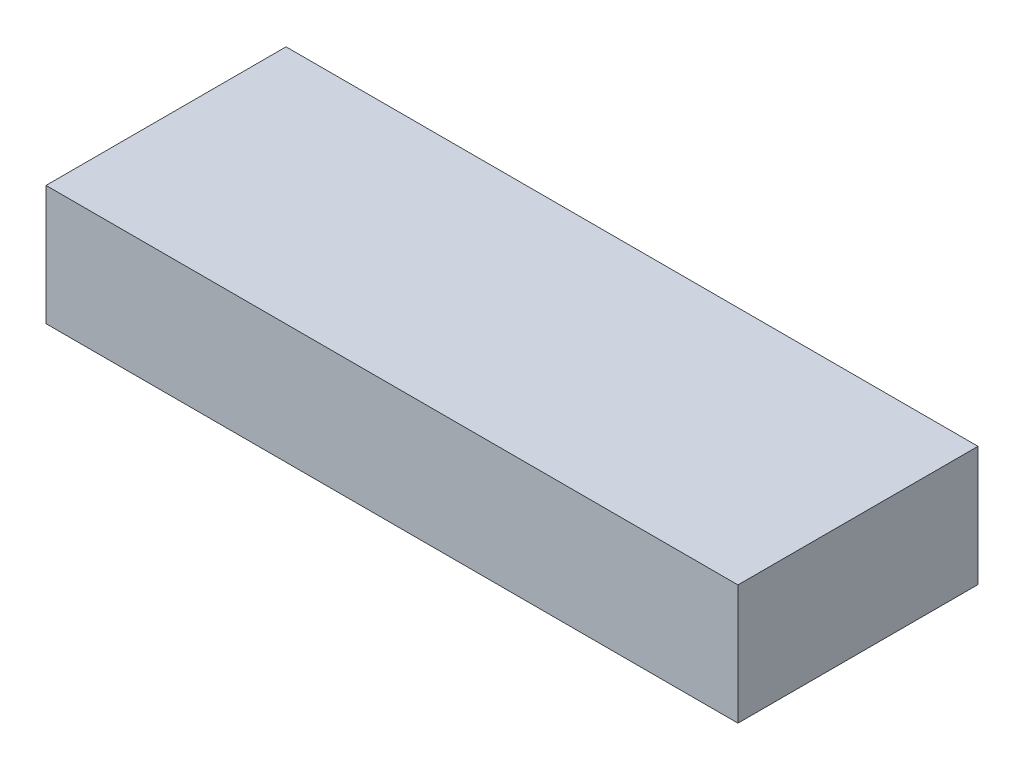
ISO-10303-21;
HEADER;
FILE_DESCRIPTION(('STEP AP214'),'2;1');
FILE_NAME('part.step','',(''),(''),'','','');
FILE_SCHEMA(('AUTOMOTIVE_DESIGN { 1 0 10303 214 1 1 1 1 }'));
ENDSEC;
DATA;
#1=APPLICATION_CONTEXT('core data for automotive mechanical design processes');
#2=APPLICATION_PROTOCOL_DEFINITION('international standard','automotive_design',2000,#1);
#3=PRODUCT_CONTEXT('',#1,'mechanical');
#4=PRODUCT('Part','Part','',(#3));
#5=PRODUCT_RELATED_PRODUCT_CATEGORY('part','',(#4));
#6=PRODUCT_DEFINITION_FORMATION('','',#4);
#7=PRODUCT_DEFINITION_CONTEXT('part definition',#1,'design');
#8=PRODUCT_DEFINITION('design','',#6,#7);
#9=PRODUCT_DEFINITION_SHAPE('','',#8);
#10=(LENGTH_UNIT() NAMED_UNIT(*) SI_UNIT(.MILLI.,.METRE.));
#11=(NAMED_UNIT(*) PLANE_ANGLE_UNIT() SI_UNIT($,.RADIAN.));
#12=(NAMED_UNIT(*) SI_UNIT($,.STERADIAN.) SOLID_ANGLE_UNIT());
#13=UNCERTAINTY_MEASURE_WITH_UNIT(LENGTH_MEASURE(1.E-05),#10,'distance_accuracy_value','');
#14=(GEOMETRIC_REPRESENTATION_CONTEXT(3) GLOBAL_UNCERTAINTY_ASSIGNED_CONTEXT((#13)) GLOBAL_UNIT_ASSIGNED_CONTEXT((#10,
#11,#12)) REPRESENTATION_CONTEXT('',''));
#15=CARTESIAN_POINT('',(0.,0.,0.));
#16=DIRECTION('',(0.,0.,1.));
#17=DIRECTION('',(1.,0.,0.));
#18=AXIS2_PLACEMENT_3D('',#15,#16,#17);
#19=CARTESIAN_POINT('',(-0.6499987,0.11250422,0.));
#20=DIRECTION('',(0.,1.,0.));
#21=DIRECTION('',(0.,0.,1.));
#22=AXIS2_PLACEMENT_3D('',#19,#20,#21);
#23=PLANE('',#22);
#24=DIRECTION('',(0.,0.,-1.));
#25=VECTOR('',#24,1.);
#26=CARTESIAN_POINT('',(0.65000124,0.11250422,0.));
#27=LINE('',#26,#25);
#28=CARTESIAN_POINT('',(0.65000124,0.11250422,0.));
#29=VERTEX_POINT('',#28);
#30=CARTESIAN_POINT('',(0.65000124,0.11250422,0.45099986));
#31=VERTEX_POINT('',#30);
#32=EDGE_CURVE('E59',#29,#31,#27,.F.);
#33=ORIENTED_EDGE('',*,*,#32,.F.);
#34=DIRECTION('',(1.,0.,0.));
#35=VECTOR('',#34,1.);
#36=CARTESIAN_POINT('',(-0.6499987,0.11250422,0.));
#37=LINE('',#36,#35);
#38=CARTESIAN_POINT('',(-0.6499987,0.11250422,0.));
#39=VERTEX_POINT('',#38);
#40=EDGE_CURVE('E74',#29,#39,#37,.F.);
#41=ORIENTED_EDGE('',*,*,#40,.T.);
#42=DIRECTION('',(0.,0.,1.));
#43=VECTOR('',#42,1.);
#44=CARTESIAN_POINT('',(-0.6499987,0.11250422,0.));
#45=LINE('',#44,#43);
#46=CARTESIAN_POINT('',(-0.6499987,0.11250422,0.45099986));
#47=VERTEX_POINT('',#46);
#48=EDGE_CURVE('E81',#47,#39,#45,.F.);
#49=ORIENTED_EDGE('',*,*,#48,.F.);
#50=DIRECTION('',(1.,0.,0.));
#51=VECTOR('',#50,1.);
#52=CARTESIAN_POINT('',(-0.6499987,0.11250422,0.45099986));
#53=LINE('',#52,#51);
#54=EDGE_CURVE('E63',#31,#47,#53,.F.);
#55=ORIENTED_EDGE('',*,*,#54,.F.);
#56=EDGE_LOOP('',(#33,#41,#49,#55));
#57=FACE_BOUND('',#56,.T.);
#58=ADVANCED_FACE('F16',(#57),#23,.T.);
#59=CARTESIAN_POINT('',(0.65000124,0.11250422,0.));
#60=DIRECTION('',(1.,0.,0.));
#61=DIRECTION('',(0.,0.,-1.));
#62=AXIS2_PLACEMENT_3D('',#59,#60,#61);
#63=PLANE('',#62);
#64=DIRECTION('',(0.,0.,1.));
#65=VECTOR('',#64,1.);
#66=CARTESIAN_POINT('',(0.65000124,-0.11250168,0.));
#67=LINE('',#66,#65);
#68=CARTESIAN_POINT('',(0.65000124,-0.11250168,0.));
#69=VERTEX_POINT('',#68);
#70=CARTESIAN_POINT('',(0.65000124,-0.11250168,0.45099986));
#71=VERTEX_POINT('',#70);
#72=EDGE_CURVE('E57',#69,#71,#67,.T.);
#73=ORIENTED_EDGE('',*,*,#72,.F.);
#74=DIRECTION('',(0.,1.,0.));
#75=VECTOR('',#74,1.);
#76=CARTESIAN_POINT('',(0.65000124,0.11250422,0.));
#77=LINE('',#76,#75);
#78=EDGE_CURVE('E85',#69,#29,#77,.T.);
#79=ORIENTED_EDGE('',*,*,#78,.T.);
#80=ORIENTED_EDGE('',*,*,#32,.T.);
#81=DIRECTION('',(0.,1.,0.));
#82=VECTOR('',#81,1.);
#83=CARTESIAN_POINT('',(0.65000124,-0.11249406,0.45099986));
#84=LINE('',#83,#82);
#85=EDGE_CURVE('E19',#71,#31,#84,.T.);
#86=ORIENTED_EDGE('',*,*,#85,.F.);
#87=EDGE_LOOP('',(#73,#79,#80,#86));
#88=FACE_BOUND('',#87,.T.);
#89=ADVANCED_FACE('F54',(#88),#63,.T.);
#90=CARTESIAN_POINT('',(-0.6499987,-0.11249406,0.45099986));
#91=DIRECTION('',(0.,0.,1.));
#92=DIRECTION('',(1.,0.,0.));
#93=AXIS2_PLACEMENT_3D('',#90,#91,#92);
#94=PLANE('',#93);
#95=ORIENTED_EDGE('',*,*,#54,.T.);
#96=DIRECTION('',(0.,1.,0.));
#97=VECTOR('',#96,1.);
#98=CARTESIAN_POINT('',(-0.6499987,-0.11249406,0.45099986));
#99=LINE('',#98,#97);
#100=CARTESIAN_POINT('',(-0.6499987,-0.112494060000009,0.45099986));
#101=VERTEX_POINT('',#100);
#102=EDGE_CURVE('E68',#101,#47,#99,.T.);
#103=ORIENTED_EDGE('',*,*,#102,.F.);
#104=DIRECTION('',(0.999999999982821,-5.86153872503995E-06,0.));
#105=VECTOR('',#104,1.);
#106=CARTESIAN_POINT('',(0.65000124,-0.11250168,0.45099986));
#107=LINE('',#106,#105);
#108=EDGE_CURVE('E65',#71,#101,#107,.F.);
#109=ORIENTED_EDGE('',*,*,#108,.F.);
#110=ORIENTED_EDGE('',*,*,#85,.T.);
#111=EDGE_LOOP('',(#95,#103,#109,#110));
#112=FACE_BOUND('',#111,.T.);
#113=ADVANCED_FACE('F66',(#112),#94,.T.);
#114=CARTESIAN_POINT('',(-0.6499987,-0.11249406,0.));
#115=DIRECTION('',(-1.,0.,0.));
#116=DIRECTION('',(0.,0.,1.));
#117=AXIS2_PLACEMENT_3D('',#114,#115,#116);
#118=PLANE('',#117);
#119=ORIENTED_EDGE('',*,*,#48,.T.);
#120=DIRECTION('',(0.,1.,0.));
#121=VECTOR('',#120,1.);
#122=CARTESIAN_POINT('',(-0.6499987,-0.11249406,0.));
#123=LINE('',#122,#121);
#124=CARTESIAN_POINT('',(-0.6499987,-0.112494060000009,0.));
#125=VERTEX_POINT('',#124);
#126=EDGE_CURVE('E34',#39,#125,#123,.F.);
#127=ORIENTED_EDGE('',*,*,#126,.T.);
#128=DIRECTION('',(0.,0.,1.));
#129=VECTOR('',#128,1.);
#130=CARTESIAN_POINT('',(-0.6499987,-0.112494060000009,0.));
#131=LINE('',#130,#129);
#132=EDGE_CURVE('E25',#101,#125,#131,.F.);
#133=ORIENTED_EDGE('',*,*,#132,.F.);
#134=ORIENTED_EDGE('',*,*,#102,.T.);
#135=EDGE_LOOP('',(#119,#127,#133,#134));
#136=FACE_BOUND('',#135,.T.);
#137=ADVANCED_FACE('F100',(#136),#118,.T.);
#138=CARTESIAN_POINT('',(-0.6499987,-0.11249406,0.));
#139=DIRECTION('',(0.,0.,1.));
#140=DIRECTION('',(1.,0.,0.));
#141=AXIS2_PLACEMENT_3D('',#138,#139,#140);
#142=PLANE('',#141);
#143=ORIENTED_EDGE('',*,*,#40,.F.);
#144=ORIENTED_EDGE('',*,*,#78,.F.);
#145=DIRECTION('',(0.999999999982821,-5.86153872503995E-06,0.));
#146=VECTOR('',#145,1.);
#147=CARTESIAN_POINT('',(0.65000124,-0.11250168,0.));
#148=LINE('',#147,#146);
#149=EDGE_CURVE('E11',#125,#69,#148,.T.);
#150=ORIENTED_EDGE('',*,*,#149,.F.);
#151=ORIENTED_EDGE('',*,*,#126,.F.);
#152=EDGE_LOOP('',(#143,#144,#150,#151));
#153=FACE_BOUND('',#152,.T.);
#154=ADVANCED_FACE('F97',(#153),#142,.F.);
#155=CARTESIAN_POINT('',(0.65000124,-0.11250168,0.));
#156=DIRECTION('',(-5.86153872503995E-06,-0.999999999982821,0.));
#157=DIRECTION('',(0.999999999982821,-5.86153872503995E-06,0.));
#158=AXIS2_PLACEMENT_3D('',#155,#156,#157);
#159=PLANE('',#158);
#160=ORIENTED_EDGE('',*,*,#132,.T.);
#161=ORIENTED_EDGE('',*,*,#149,.T.);
#162=ORIENTED_EDGE('',*,*,#72,.T.);
#163=ORIENTED_EDGE('',*,*,#108,.T.);
#164=EDGE_LOOP('',(#160,#161,#162,#163));
#165=FACE_BOUND('',#164,.T.);
#166=ADVANCED_FACE('F72',(#165),#159,.T.);
#167=CLOSED_SHELL('',(#58,#89,#113,#137,#154,#166));
#168=MANIFOLD_SOLID_BREP('B1',#167);
#169=ADVANCED_BREP_SHAPE_REPRESENTATION('',(#18,#168),#14);
#170=SHAPE_DEFINITION_REPRESENTATION(#9,#169);
ENDSEC;
END-ISO-10303-21;
